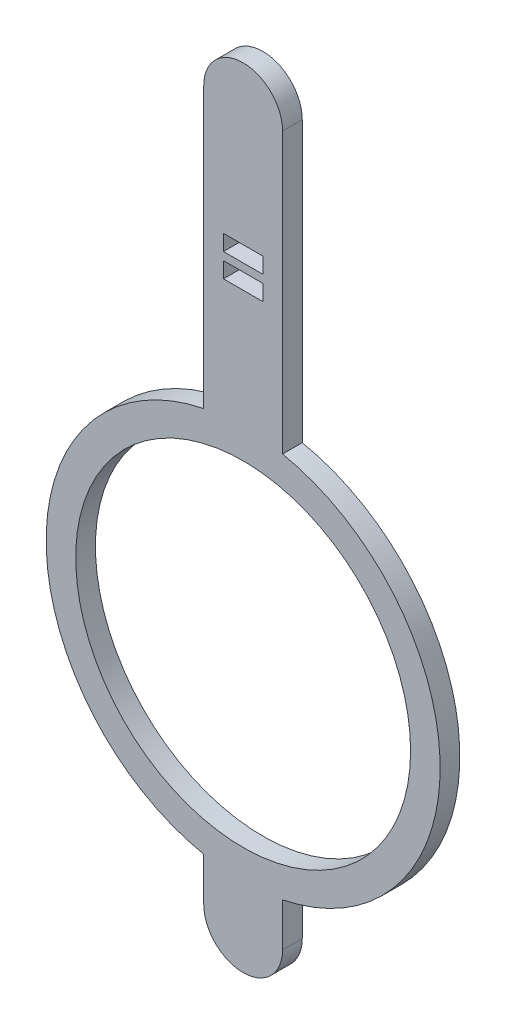
ISO-10303-21;
HEADER;
FILE_DESCRIPTION(('STEP AP214'),'2;1');
FILE_NAME('part.step','',(''),(''),'','','');
FILE_SCHEMA(('AUTOMOTIVE_DESIGN { 1 0 10303 214 1 1 1 1 }'));
ENDSEC;
DATA;
#1=APPLICATION_CONTEXT('core data for automotive mechanical design processes');
#2=APPLICATION_PROTOCOL_DEFINITION('international standard','automotive_design',2000,#1);
#3=PRODUCT_CONTEXT('',#1,'mechanical');
#4=PRODUCT('Part','Part','',(#3));
#5=PRODUCT_RELATED_PRODUCT_CATEGORY('part','',(#4));
#6=PRODUCT_DEFINITION_FORMATION('','',#4);
#7=PRODUCT_DEFINITION_CONTEXT('part definition',#1,'design');
#8=PRODUCT_DEFINITION('design','',#6,#7);
#9=PRODUCT_DEFINITION_SHAPE('','',#8);
#10=(LENGTH_UNIT() NAMED_UNIT(*) SI_UNIT(.MILLI.,.METRE.));
#11=(NAMED_UNIT(*) PLANE_ANGLE_UNIT() SI_UNIT($,.RADIAN.));
#12=(NAMED_UNIT(*) SI_UNIT($,.STERADIAN.) SOLID_ANGLE_UNIT());
#13=UNCERTAINTY_MEASURE_WITH_UNIT(LENGTH_MEASURE(1.E-05),#10,'distance_accuracy_value','');
#14=(GEOMETRIC_REPRESENTATION_CONTEXT(3) GLOBAL_UNCERTAINTY_ASSIGNED_CONTEXT((#13)) GLOBAL_UNIT_ASSIGNED_CONTEXT((#10,
#11,#12)) REPRESENTATION_CONTEXT('',''));
#15=CARTESIAN_POINT('',(0.,0.,0.));
#16=DIRECTION('',(0.,0.,1.));
#17=DIRECTION('',(1.,0.,0.));
#18=AXIS2_PLACEMENT_3D('',#15,#16,#17);
#19=CARTESIAN_POINT('',(0.,6.,0.25));
#20=DIRECTION('',(0.,0.,1.));
#21=DIRECTION('',(1.,0.,0.));
#22=AXIS2_PLACEMENT_3D('',#19,#20,#21);
#23=PLANE('',#22);
#24=DIRECTION('',(0.,-1.,0.));
#25=VECTOR('',#24,1.);
#26=CARTESIAN_POINT('',(0.25,4.2,0.25));
#27=LINE('',#26,#25);
#28=CARTESIAN_POINT('',(0.25,4.2,0.25));
#29=VERTEX_POINT('',#28);
#30=CARTESIAN_POINT('',(0.25,4.,0.25));
#31=VERTEX_POINT('',#30);
#32=EDGE_CURVE('E159',#29,#31,#27,.T.);
#33=ORIENTED_EDGE('',*,*,#32,.T.);
#34=DIRECTION('',(-1.,0.,0.));
#35=VECTOR('',#34,1.);
#36=CARTESIAN_POINT('',(0.25,4.,0.25));
#37=LINE('',#36,#35);
#38=CARTESIAN_POINT('',(-0.25,4.,0.25));
#39=VERTEX_POINT('',#38);
#40=EDGE_CURVE('E148',#31,#39,#37,.T.);
#41=ORIENTED_EDGE('',*,*,#40,.T.);
#42=DIRECTION('',(0.,1.,0.));
#43=VECTOR('',#42,1.);
#44=CARTESIAN_POINT('',(-0.25,4.2,0.25));
#45=LINE('',#44,#43);
#46=CARTESIAN_POINT('',(-0.25,4.2,0.25));
#47=VERTEX_POINT('',#46);
#48=EDGE_CURVE('E169',#39,#47,#45,.T.);
#49=ORIENTED_EDGE('',*,*,#48,.T.);
#50=DIRECTION('',(1.,0.,0.));
#51=VECTOR('',#50,1.);
#52=CARTESIAN_POINT('',(0.25,4.2,0.25));
#53=LINE('',#52,#51);
#54=EDGE_CURVE('E165',#47,#29,#53,.T.);
#55=ORIENTED_EDGE('',*,*,#54,.T.);
#56=EDGE_LOOP('',(#33,#41,#49,#55));
#57=FACE_BOUND('',#56,.T.);
#58=DIRECTION('',(0.,-1.,0.));
#59=VECTOR('',#58,1.);
#60=CARTESIAN_POINT('',(0.25,4.3,0.25));
#61=LINE('',#60,#59);
#62=CARTESIAN_POINT('',(0.25,4.5,0.25));
#63=VERTEX_POINT('',#62);
#64=CARTESIAN_POINT('',(0.25,4.3,0.25));
#65=VERTEX_POINT('',#64);
#66=EDGE_CURVE('E188',#63,#65,#61,.T.);
#67=ORIENTED_EDGE('',*,*,#66,.T.);
#68=DIRECTION('',(-1.,0.,0.));
#69=VECTOR('',#68,1.);
#70=CARTESIAN_POINT('',(0.25,4.3,0.25));
#71=LINE('',#70,#69);
#72=CARTESIAN_POINT('',(-0.25,4.3,0.25));
#73=VERTEX_POINT('',#72);
#74=EDGE_CURVE('E205',#65,#73,#71,.T.);
#75=ORIENTED_EDGE('',*,*,#74,.T.);
#76=DIRECTION('',(0.,1.,0.));
#77=VECTOR('',#76,1.);
#78=CARTESIAN_POINT('',(-0.25,4.3,0.25));
#79=LINE('',#78,#77);
#80=CARTESIAN_POINT('',(-0.25,4.5,0.25));
#81=VERTEX_POINT('',#80);
#82=EDGE_CURVE('E155',#73,#81,#79,.T.);
#83=ORIENTED_EDGE('',*,*,#82,.T.);
#84=DIRECTION('',(1.,0.,0.));
#85=VECTOR('',#84,1.);
#86=CARTESIAN_POINT('',(0.25,4.5,0.25));
#87=LINE('',#86,#85);
#88=EDGE_CURVE('E185',#81,#63,#87,.T.);
#89=ORIENTED_EDGE('',*,*,#88,.T.);
#90=EDGE_LOOP('',(#67,#75,#83,#89));
#91=FACE_BOUND('',#90,.T.);
#92=CARTESIAN_POINT('',(0.,6.,0.25));
#93=DIRECTION('',(0.,0.,1.));
#94=DIRECTION('',(1.,0.,0.));
#95=AXIS2_PLACEMENT_3D('',#92,#93,#94);
#96=CIRCLE('',#95,0.5);
#97=CARTESIAN_POINT('',(0.5,6.,0.25));
#98=VERTEX_POINT('',#97);
#99=CARTESIAN_POINT('',(-0.5,6.,0.25));
#100=VERTEX_POINT('',#99);
#101=EDGE_CURVE('E221',#98,#100,#96,.T.);
#102=ORIENTED_EDGE('',*,*,#101,.T.);
#103=DIRECTION('',(0.,-1.,0.));
#104=VECTOR('',#103,1.);
#105=CARTESIAN_POINT('',(-0.5,2.44948974278318,0.25));
#106=LINE('',#105,#104);
#107=CARTESIAN_POINT('',(-0.5,2.44948974278318,0.25));
#108=VERTEX_POINT('',#107);
#109=EDGE_CURVE('E224',#100,#108,#106,.T.);
#110=ORIENTED_EDGE('',*,*,#109,.T.);
#111=CARTESIAN_POINT('',(0.,0.,0.25));
#112=DIRECTION('',(0.,0.,1.));
#113=DIRECTION('',(1.,0.,0.));
#114=AXIS2_PLACEMENT_3D('',#111,#112,#113);
#115=CIRCLE('',#114,2.5);
#116=CARTESIAN_POINT('',(-0.5,-2.44948974278318,0.25));
#117=VERTEX_POINT('',#116);
#118=EDGE_CURVE('E227',#108,#117,#115,.T.);
#119=ORIENTED_EDGE('',*,*,#118,.T.);
#120=DIRECTION('',(0.,-1.,0.));
#121=VECTOR('',#120,1.);
#122=CARTESIAN_POINT('',(-0.5,-2.44948974278318,0.25));
#123=LINE('',#122,#121);
#124=CARTESIAN_POINT('',(-0.5,-3.,0.25));
#125=VERTEX_POINT('',#124);
#126=EDGE_CURVE('E229',#117,#125,#123,.T.);
#127=ORIENTED_EDGE('',*,*,#126,.T.);
#128=CARTESIAN_POINT('',(0.,-3.,0.25));
#129=DIRECTION('',(0.,0.,1.));
#130=DIRECTION('',(1.,0.,0.));
#131=AXIS2_PLACEMENT_3D('',#128,#129,#130);
#132=CIRCLE('',#131,0.5);
#133=CARTESIAN_POINT('',(0.5,-3.,0.25));
#134=VERTEX_POINT('',#133);
#135=EDGE_CURVE('E231',#125,#134,#132,.T.);
#136=ORIENTED_EDGE('',*,*,#135,.T.);
#137=DIRECTION('',(0.,1.,0.));
#138=VECTOR('',#137,1.);
#139=CARTESIAN_POINT('',(0.5,-2.44948974278318,0.25));
#140=LINE('',#139,#138);
#141=CARTESIAN_POINT('',(0.5,-2.44948974278318,0.25));
#142=VERTEX_POINT('',#141);
#143=EDGE_CURVE('E233',#134,#142,#140,.T.);
#144=ORIENTED_EDGE('',*,*,#143,.T.);
#145=CARTESIAN_POINT('',(0.,0.,0.25));
#146=DIRECTION('',(0.,0.,1.));
#147=DIRECTION('',(1.,0.,0.));
#148=AXIS2_PLACEMENT_3D('',#145,#146,#147);
#149=CIRCLE('',#148,2.5);
#150=CARTESIAN_POINT('',(0.5,2.44948974278318,0.25));
#151=VERTEX_POINT('',#150);
#152=EDGE_CURVE('E235',#142,#151,#149,.T.);
#153=ORIENTED_EDGE('',*,*,#152,.T.);
#154=DIRECTION('',(0.,1.,0.));
#155=VECTOR('',#154,1.);
#156=CARTESIAN_POINT('',(0.5,2.44948974278318,0.25));
#157=LINE('',#156,#155);
#158=EDGE_CURVE('E237',#151,#98,#157,.T.);
#159=ORIENTED_EDGE('',*,*,#158,.T.);
#160=EDGE_LOOP('',(#102,#110,#119,#127,#136,#144,#153,#159));
#161=FACE_BOUND('',#160,.T.);
#162=CARTESIAN_POINT('',(0.,0.,0.25));
#163=DIRECTION('',(0.,0.,1.));
#164=DIRECTION('',(1.,0.,0.));
#165=AXIS2_PLACEMENT_3D('',#162,#163,#164);
#166=CIRCLE('',#165,2.125);
#167=CARTESIAN_POINT('',(2.125,0.,0.25));
#168=VERTEX_POINT('',#167);
#169=EDGE_CURVE('E215',#168,#168,#166,.T.);
#170=ORIENTED_EDGE('',*,*,#169,.F.);
#171=EDGE_LOOP('',(#170));
#172=FACE_BOUND('',#171,.T.);
#173=ADVANCED_FACE('F36',(#57,#91,#161,#172),#23,.T.);
#174=CARTESIAN_POINT('',(0.,6.,0.));
#175=DIRECTION('',(0.,0.,1.));
#176=DIRECTION('',(1.,0.,0.));
#177=AXIS2_PLACEMENT_3D('',#174,#175,#176);
#178=PLANE('',#177);
#179=DIRECTION('',(-1.,0.,0.));
#180=VECTOR('',#179,1.);
#181=CARTESIAN_POINT('',(0.25,4.,0.));
#182=LINE('',#181,#180);
#183=CARTESIAN_POINT('',(0.25,4.,0.));
#184=VERTEX_POINT('',#183);
#185=CARTESIAN_POINT('',(-0.25,4.,0.));
#186=VERTEX_POINT('',#185);
#187=EDGE_CURVE('E167',#184,#186,#182,.T.);
#188=ORIENTED_EDGE('',*,*,#187,.F.);
#189=DIRECTION('',(0.,-1.,0.));
#190=VECTOR('',#189,1.);
#191=CARTESIAN_POINT('',(0.25,4.2,0.));
#192=LINE('',#191,#190);
#193=CARTESIAN_POINT('',(0.25,4.2,0.));
#194=VERTEX_POINT('',#193);
#195=EDGE_CURVE('E59',#194,#184,#192,.T.);
#196=ORIENTED_EDGE('',*,*,#195,.F.);
#197=DIRECTION('',(1.,0.,0.));
#198=VECTOR('',#197,1.);
#199=CARTESIAN_POINT('',(0.25,4.2,0.));
#200=LINE('',#199,#198);
#201=CARTESIAN_POINT('',(-0.25,4.2,0.));
#202=VERTEX_POINT('',#201);
#203=EDGE_CURVE('E161',#202,#194,#200,.T.);
#204=ORIENTED_EDGE('',*,*,#203,.F.);
#205=DIRECTION('',(0.,1.,0.));
#206=VECTOR('',#205,1.);
#207=CARTESIAN_POINT('',(-0.25,4.2,0.));
#208=LINE('',#207,#206);
#209=EDGE_CURVE('E174',#186,#202,#208,.T.);
#210=ORIENTED_EDGE('',*,*,#209,.F.);
#211=EDGE_LOOP('',(#188,#196,#204,#210));
#212=FACE_BOUND('',#211,.T.);
#213=DIRECTION('',(-1.,0.,0.));
#214=VECTOR('',#213,1.);
#215=CARTESIAN_POINT('',(0.25,4.3,0.));
#216=LINE('',#215,#214);
#217=CARTESIAN_POINT('',(0.25,4.3,0.));
#218=VERTEX_POINT('',#217);
#219=CARTESIAN_POINT('',(-0.25,4.3,0.));
#220=VERTEX_POINT('',#219);
#221=EDGE_CURVE('E193',#218,#220,#216,.T.);
#222=ORIENTED_EDGE('',*,*,#221,.F.);
#223=DIRECTION('',(0.,-1.,0.));
#224=VECTOR('',#223,1.);
#225=CARTESIAN_POINT('',(0.25,4.3,0.));
#226=LINE('',#225,#224);
#227=CARTESIAN_POINT('',(0.25,4.5,0.));
#228=VERTEX_POINT('',#227);
#229=EDGE_CURVE('E191',#228,#218,#226,.T.);
#230=ORIENTED_EDGE('',*,*,#229,.F.);
#231=DIRECTION('',(1.,0.,0.));
#232=VECTOR('',#231,1.);
#233=CARTESIAN_POINT('',(0.25,4.5,0.));
#234=LINE('',#233,#232);
#235=CARTESIAN_POINT('',(-0.25,4.5,0.));
#236=VERTEX_POINT('',#235);
#237=EDGE_CURVE('E199',#236,#228,#234,.T.);
#238=ORIENTED_EDGE('',*,*,#237,.F.);
#239=DIRECTION('',(0.,1.,0.));
#240=VECTOR('',#239,1.);
#241=CARTESIAN_POINT('',(-0.25,4.3,0.));
#242=LINE('',#241,#240);
#243=EDGE_CURVE('E196',#220,#236,#242,.T.);
#244=ORIENTED_EDGE('',*,*,#243,.F.);
#245=EDGE_LOOP('',(#222,#230,#238,#244));
#246=FACE_BOUND('',#245,.T.);
#247=CARTESIAN_POINT('',(0.,6.,0.));
#248=DIRECTION('',(0.,0.,1.));
#249=DIRECTION('',(1.,0.,0.));
#250=AXIS2_PLACEMENT_3D('',#247,#248,#249);
#251=CIRCLE('',#250,0.5);
#252=CARTESIAN_POINT('',(0.5,6.,0.));
#253=VERTEX_POINT('',#252);
#254=CARTESIAN_POINT('',(-0.5,6.,0.));
#255=VERTEX_POINT('',#254);
#256=EDGE_CURVE('E218',#253,#255,#251,.T.);
#257=ORIENTED_EDGE('',*,*,#256,.F.);
#258=DIRECTION('',(0.,1.,0.));
#259=VECTOR('',#258,1.);
#260=CARTESIAN_POINT('',(0.5,2.44948974278318,0.));
#261=LINE('',#260,#259);
#262=CARTESIAN_POINT('',(0.5,2.44948974278318,0.));
#263=VERTEX_POINT('',#262);
#264=EDGE_CURVE('E225',#263,#253,#261,.T.);
#265=ORIENTED_EDGE('',*,*,#264,.F.);
#266=CARTESIAN_POINT('',(0.,0.,0.));
#267=DIRECTION('',(0.,0.,1.));
#268=DIRECTION('',(1.,0.,0.));
#269=AXIS2_PLACEMENT_3D('',#266,#267,#268);
#270=CIRCLE('',#269,2.5);
#271=CARTESIAN_POINT('',(0.5,-2.44948974278318,0.));
#272=VERTEX_POINT('',#271);
#273=EDGE_CURVE('E252',#272,#263,#270,.T.);
#274=ORIENTED_EDGE('',*,*,#273,.F.);
#275=DIRECTION('',(0.,1.,0.));
#276=VECTOR('',#275,1.);
#277=CARTESIAN_POINT('',(0.5,-2.44948974278318,0.));
#278=LINE('',#277,#276);
#279=CARTESIAN_POINT('',(0.5,-3.,0.));
#280=VERTEX_POINT('',#279);
#281=EDGE_CURVE('E250',#280,#272,#278,.T.);
#282=ORIENTED_EDGE('',*,*,#281,.F.);
#283=CARTESIAN_POINT('',(0.,-3.,0.));
#284=DIRECTION('',(0.,0.,1.));
#285=DIRECTION('',(1.,0.,0.));
#286=AXIS2_PLACEMENT_3D('',#283,#284,#285);
#287=CIRCLE('',#286,0.5);
#288=CARTESIAN_POINT('',(-0.5,-3.,0.));
#289=VERTEX_POINT('',#288);
#290=EDGE_CURVE('E248',#289,#280,#287,.T.);
#291=ORIENTED_EDGE('',*,*,#290,.F.);
#292=DIRECTION('',(0.,-1.,0.));
#293=VECTOR('',#292,1.);
#294=CARTESIAN_POINT('',(-0.5,-2.44948974278318,0.));
#295=LINE('',#294,#293);
#296=CARTESIAN_POINT('',(-0.5,-2.44948974278318,0.));
#297=VERTEX_POINT('',#296);
#298=EDGE_CURVE('E246',#297,#289,#295,.T.);
#299=ORIENTED_EDGE('',*,*,#298,.F.);
#300=CARTESIAN_POINT('',(0.,0.,0.));
#301=DIRECTION('',(0.,0.,1.));
#302=DIRECTION('',(1.,0.,0.));
#303=AXIS2_PLACEMENT_3D('',#300,#301,#302);
#304=CIRCLE('',#303,2.5);
#305=CARTESIAN_POINT('',(-0.5,2.44948974278318,0.));
#306=VERTEX_POINT('',#305);
#307=EDGE_CURVE('E244',#306,#297,#304,.T.);
#308=ORIENTED_EDGE('',*,*,#307,.F.);
#309=DIRECTION('',(0.,-1.,0.));
#310=VECTOR('',#309,1.);
#311=CARTESIAN_POINT('',(-0.5,2.44948974278318,0.));
#312=LINE('',#311,#310);
#313=EDGE_CURVE('E242',#255,#306,#312,.T.);
#314=ORIENTED_EDGE('',*,*,#313,.F.);
#315=EDGE_LOOP('',(#257,#265,#274,#282,#291,#299,#308,#314));
#316=FACE_BOUND('',#315,.T.);
#317=CARTESIAN_POINT('',(0.,0.,0.));
#318=DIRECTION('',(0.,0.,1.));
#319=DIRECTION('',(1.,0.,0.));
#320=AXIS2_PLACEMENT_3D('',#317,#318,#319);
#321=CIRCLE('',#320,2.125);
#322=CARTESIAN_POINT('',(2.125,0.,0.));
#323=VERTEX_POINT('',#322);
#324=EDGE_CURVE('E214',#323,#323,#321,.T.);
#325=ORIENTED_EDGE('',*,*,#324,.T.);
#326=EDGE_LOOP('',(#325));
#327=FACE_BOUND('',#326,.T.);
#328=ADVANCED_FACE('F282',(#212,#246,#316,#327),#178,.F.);
#329=CARTESIAN_POINT('',(0.,6.,0.25));
#330=DIRECTION('',(0.,0.,-1.));
#331=DIRECTION('',(-1.,0.,0.));
#332=AXIS2_PLACEMENT_3D('',#329,#330,#331);
#333=CYLINDRICAL_SURFACE('',#332,0.5);
#334=ORIENTED_EDGE('',*,*,#256,.T.);
#335=DIRECTION('',(0.,0.,-1.));
#336=VECTOR('',#335,1.);
#337=CARTESIAN_POINT('',(-0.5,6.,0.25));
#338=LINE('',#337,#336);
#339=EDGE_CURVE('E11',#100,#255,#338,.T.);
#340=ORIENTED_EDGE('',*,*,#339,.F.);
#341=ORIENTED_EDGE('',*,*,#101,.F.);
#342=DIRECTION('',(0.,0.,-1.));
#343=VECTOR('',#342,1.);
#344=CARTESIAN_POINT('',(0.5,6.,0.25));
#345=LINE('',#344,#343);
#346=EDGE_CURVE('E239',#98,#253,#345,.T.);
#347=ORIENTED_EDGE('',*,*,#346,.T.);
#348=EDGE_LOOP('',(#334,#340,#341,#347));
#349=FACE_BOUND('',#348,.T.);
#350=ADVANCED_FACE('F38',(#349),#333,.T.);
#351=CARTESIAN_POINT('',(-0.5,2.44948974278318,0.25));
#352=DIRECTION('',(1.,0.,0.));
#353=DIRECTION('',(0.,0.,-1.));
#354=AXIS2_PLACEMENT_3D('',#351,#352,#353);
#355=PLANE('',#354);
#356=ORIENTED_EDGE('',*,*,#313,.T.);
#357=DIRECTION('',(0.,0.,-1.));
#358=VECTOR('',#357,1.);
#359=CARTESIAN_POINT('',(-0.5,2.44948974278318,0.25));
#360=LINE('',#359,#358);
#361=EDGE_CURVE('E44',#108,#306,#360,.T.);
#362=ORIENTED_EDGE('',*,*,#361,.F.);
#363=ORIENTED_EDGE('',*,*,#109,.F.);
#364=ORIENTED_EDGE('',*,*,#339,.T.);
#365=EDGE_LOOP('',(#356,#362,#363,#364));
#366=FACE_BOUND('',#365,.T.);
#367=ADVANCED_FACE('F300',(#366),#355,.F.);
#368=CARTESIAN_POINT('',(0.,0.,0.25));
#369=DIRECTION('',(0.,0.,-1.));
#370=DIRECTION('',(-1.,0.,0.));
#371=AXIS2_PLACEMENT_3D('',#368,#369,#370);
#372=CYLINDRICAL_SURFACE('',#371,2.5);
#373=ORIENTED_EDGE('',*,*,#307,.T.);
#374=DIRECTION('',(0.,0.,-1.));
#375=VECTOR('',#374,1.);
#376=CARTESIAN_POINT('',(-0.5,-2.44948974278318,0.25));
#377=LINE('',#376,#375);
#378=EDGE_CURVE('E269',#117,#297,#377,.T.);
#379=ORIENTED_EDGE('',*,*,#378,.F.);
#380=ORIENTED_EDGE('',*,*,#118,.F.);
#381=ORIENTED_EDGE('',*,*,#361,.T.);
#382=EDGE_LOOP('',(#373,#379,#380,#381));
#383=FACE_BOUND('',#382,.T.);
#384=ADVANCED_FACE('F276',(#383),#372,.T.);
#385=CARTESIAN_POINT('',(-0.5,-2.44948974278318,0.25));
#386=DIRECTION('',(1.,0.,0.));
#387=DIRECTION('',(0.,0.,-1.));
#388=AXIS2_PLACEMENT_3D('',#385,#386,#387);
#389=PLANE('',#388);
#390=ORIENTED_EDGE('',*,*,#298,.T.);
#391=DIRECTION('',(0.,0.,-1.));
#392=VECTOR('',#391,1.);
#393=CARTESIAN_POINT('',(-0.5,-3.,0.25));
#394=LINE('',#393,#392);
#395=EDGE_CURVE('E266',#125,#289,#394,.T.);
#396=ORIENTED_EDGE('',*,*,#395,.F.);
#397=ORIENTED_EDGE('',*,*,#126,.F.);
#398=ORIENTED_EDGE('',*,*,#378,.T.);
#399=EDGE_LOOP('',(#390,#396,#397,#398));
#400=FACE_BOUND('',#399,.T.);
#401=ADVANCED_FACE('F288',(#400),#389,.F.);
#402=CARTESIAN_POINT('',(0.,-3.,0.25));
#403=DIRECTION('',(0.,0.,-1.));
#404=DIRECTION('',(-1.,0.,0.));
#405=AXIS2_PLACEMENT_3D('',#402,#403,#404);
#406=CYLINDRICAL_SURFACE('',#405,0.5);
#407=ORIENTED_EDGE('',*,*,#290,.T.);
#408=DIRECTION('',(0.,0.,-1.));
#409=VECTOR('',#408,1.);
#410=CARTESIAN_POINT('',(0.5,-3.,0.25));
#411=LINE('',#410,#409);
#412=EDGE_CURVE('E263',#134,#280,#411,.T.);
#413=ORIENTED_EDGE('',*,*,#412,.F.);
#414=ORIENTED_EDGE('',*,*,#135,.F.);
#415=ORIENTED_EDGE('',*,*,#395,.T.);
#416=EDGE_LOOP('',(#407,#413,#414,#415));
#417=FACE_BOUND('',#416,.T.);
#418=ADVANCED_FACE('F292',(#417),#406,.T.);
#419=CARTESIAN_POINT('',(0.5,-2.44948974278318,0.25));
#420=DIRECTION('',(-1.,0.,0.));
#421=DIRECTION('',(0.,-1.,0.));
#422=AXIS2_PLACEMENT_3D('',#419,#420,#421);
#423=PLANE('',#422);
#424=ORIENTED_EDGE('',*,*,#281,.T.);
#425=DIRECTION('',(0.,0.,-1.));
#426=VECTOR('',#425,1.);
#427=CARTESIAN_POINT('',(0.5,-2.44948974278318,0.25));
#428=LINE('',#427,#426);
#429=EDGE_CURVE('E260',#142,#272,#428,.T.);
#430=ORIENTED_EDGE('',*,*,#429,.F.);
#431=ORIENTED_EDGE('',*,*,#143,.F.);
#432=ORIENTED_EDGE('',*,*,#412,.T.);
#433=EDGE_LOOP('',(#424,#430,#431,#432));
#434=FACE_BOUND('',#433,.T.);
#435=ADVANCED_FACE('F313',(#434),#423,.F.);
#436=CARTESIAN_POINT('',(0.,0.,0.25));
#437=DIRECTION('',(0.,0.,-1.));
#438=DIRECTION('',(-1.,0.,0.));
#439=AXIS2_PLACEMENT_3D('',#436,#437,#438);
#440=CYLINDRICAL_SURFACE('',#439,2.5);
#441=ORIENTED_EDGE('',*,*,#273,.T.);
#442=DIRECTION('',(0.,0.,-1.));
#443=VECTOR('',#442,1.);
#444=CARTESIAN_POINT('',(0.5,2.44948974278318,0.25));
#445=LINE('',#444,#443);
#446=EDGE_CURVE('E257',#151,#263,#445,.T.);
#447=ORIENTED_EDGE('',*,*,#446,.F.);
#448=ORIENTED_EDGE('',*,*,#152,.F.);
#449=ORIENTED_EDGE('',*,*,#429,.T.);
#450=EDGE_LOOP('',(#441,#447,#448,#449));
#451=FACE_BOUND('',#450,.T.);
#452=ADVANCED_FACE('F311',(#451),#440,.T.);
#453=CARTESIAN_POINT('',(0.5,2.44948974278318,0.25));
#454=DIRECTION('',(-1.,0.,0.));
#455=DIRECTION('',(0.,0.,1.));
#456=AXIS2_PLACEMENT_3D('',#453,#454,#455);
#457=PLANE('',#456);
#458=ORIENTED_EDGE('',*,*,#264,.T.);
#459=ORIENTED_EDGE('',*,*,#346,.F.);
#460=ORIENTED_EDGE('',*,*,#158,.F.);
#461=ORIENTED_EDGE('',*,*,#446,.T.);
#462=EDGE_LOOP('',(#458,#459,#460,#461));
#463=FACE_BOUND('',#462,.T.);
#464=ADVANCED_FACE('F306',(#463),#457,.F.);
#465=CARTESIAN_POINT('',(0.,0.,0.25));
#466=DIRECTION('',(0.,0.,-1.));
#467=DIRECTION('',(-1.,0.,0.));
#468=AXIS2_PLACEMENT_3D('',#465,#466,#467);
#469=CYLINDRICAL_SURFACE('',#468,2.125);
#470=ORIENTED_EDGE('',*,*,#324,.F.);
#471=EDGE_LOOP('',(#470));
#472=FACE_BOUND('',#471,.T.);
#473=ORIENTED_EDGE('',*,*,#169,.T.);
#474=EDGE_LOOP('',(#473));
#475=FACE_BOUND('',#474,.T.);
#476=ADVANCED_FACE('F330',(#472,#475),#469,.F.);
#477=CARTESIAN_POINT('',(0.25,4.3,0.251));
#478=DIRECTION('',(1.,0.,0.));
#479=DIRECTION('',(0.,0.,-1.));
#480=AXIS2_PLACEMENT_3D('',#477,#478,#479);
#481=PLANE('',#480);
#482=DIRECTION('',(0.,0.,-1.));
#483=VECTOR('',#482,1.);
#484=CARTESIAN_POINT('',(0.25,4.5,0.251));
#485=LINE('',#484,#483);
#486=EDGE_CURVE('E203',#63,#228,#485,.T.);
#487=ORIENTED_EDGE('',*,*,#486,.T.);
#488=ORIENTED_EDGE('',*,*,#229,.T.);
#489=DIRECTION('',(0.,0.,-1.));
#490=VECTOR('',#489,1.);
#491=CARTESIAN_POINT('',(0.25,4.3,0.251));
#492=LINE('',#491,#490);
#493=EDGE_CURVE('E202',#65,#218,#492,.T.);
#494=ORIENTED_EDGE('',*,*,#493,.F.);
#495=ORIENTED_EDGE('',*,*,#66,.F.);
#496=EDGE_LOOP('',(#487,#488,#494,#495));
#497=FACE_BOUND('',#496,.T.);
#498=ADVANCED_FACE('F337',(#497),#481,.F.);
#499=CARTESIAN_POINT('',(0.25,4.5,0.251));
#500=DIRECTION('',(0.,1.,0.));
#501=DIRECTION('',(0.,0.,1.));
#502=AXIS2_PLACEMENT_3D('',#499,#500,#501);
#503=PLANE('',#502);
#504=DIRECTION('',(0.,0.,-1.));
#505=VECTOR('',#504,1.);
#506=CARTESIAN_POINT('',(-0.25,4.5,0.251));
#507=LINE('',#506,#505);
#508=EDGE_CURVE('E206',#81,#236,#507,.T.);
#509=ORIENTED_EDGE('',*,*,#508,.T.);
#510=ORIENTED_EDGE('',*,*,#237,.T.);
#511=ORIENTED_EDGE('',*,*,#486,.F.);
#512=ORIENTED_EDGE('',*,*,#88,.F.);
#513=EDGE_LOOP('',(#509,#510,#511,#512));
#514=FACE_BOUND('',#513,.T.);
#515=ADVANCED_FACE('F342',(#514),#503,.F.);
#516=CARTESIAN_POINT('',(-0.25,4.3,0.251));
#517=DIRECTION('',(-1.,0.,0.));
#518=DIRECTION('',(0.,0.,1.));
#519=AXIS2_PLACEMENT_3D('',#516,#517,#518);
#520=PLANE('',#519);
#521=DIRECTION('',(0.,0.,-1.));
#522=VECTOR('',#521,1.);
#523=CARTESIAN_POINT('',(-0.25,4.3,0.251));
#524=LINE('',#523,#522);
#525=EDGE_CURVE('E208',#73,#220,#524,.T.);
#526=ORIENTED_EDGE('',*,*,#525,.T.);
#527=ORIENTED_EDGE('',*,*,#243,.T.);
#528=ORIENTED_EDGE('',*,*,#508,.F.);
#529=ORIENTED_EDGE('',*,*,#82,.F.);
#530=EDGE_LOOP('',(#526,#527,#528,#529));
#531=FACE_BOUND('',#530,.T.);
#532=ADVANCED_FACE('F350',(#531),#520,.F.);
#533=CARTESIAN_POINT('',(0.25,4.3,0.251));
#534=DIRECTION('',(0.,-1.,0.));
#535=DIRECTION('',(0.,0.,-1.));
#536=AXIS2_PLACEMENT_3D('',#533,#534,#535);
#537=PLANE('',#536);
#538=ORIENTED_EDGE('',*,*,#493,.T.);
#539=ORIENTED_EDGE('',*,*,#221,.T.);
#540=ORIENTED_EDGE('',*,*,#525,.F.);
#541=ORIENTED_EDGE('',*,*,#74,.F.);
#542=EDGE_LOOP('',(#538,#539,#540,#541));
#543=FACE_BOUND('',#542,.T.);
#544=ADVANCED_FACE('F354',(#543),#537,.F.);
#545=CARTESIAN_POINT('',(0.25,4.2,0.251));
#546=DIRECTION('',(1.,0.,0.));
#547=DIRECTION('',(0.,0.,-1.));
#548=AXIS2_PLACEMENT_3D('',#545,#546,#547);
#549=PLANE('',#548);
#550=DIRECTION('',(0.,0.,-1.));
#551=VECTOR('',#550,1.);
#552=CARTESIAN_POINT('',(0.25,4.2,0.251));
#553=LINE('',#552,#551);
#554=EDGE_CURVE('E156',#29,#194,#553,.T.);
#555=ORIENTED_EDGE('',*,*,#554,.T.);
#556=ORIENTED_EDGE('',*,*,#195,.T.);
#557=DIRECTION('',(0.,0.,-1.));
#558=VECTOR('',#557,1.);
#559=CARTESIAN_POINT('',(0.25,4.,0.251));
#560=LINE('',#559,#558);
#561=EDGE_CURVE('E150',#31,#184,#560,.T.);
#562=ORIENTED_EDGE('',*,*,#561,.F.);
#563=ORIENTED_EDGE('',*,*,#32,.F.);
#564=EDGE_LOOP('',(#555,#556,#562,#563));
#565=FACE_BOUND('',#564,.T.);
#566=ADVANCED_FACE('F158',(#565),#549,.F.);
#567=CARTESIAN_POINT('',(0.25,4.2,0.251));
#568=DIRECTION('',(0.,1.,0.));
#569=DIRECTION('',(0.,0.,1.));
#570=AXIS2_PLACEMENT_3D('',#567,#568,#569);
#571=PLANE('',#570);
#572=DIRECTION('',(0.,0.,-1.));
#573=VECTOR('',#572,1.);
#574=CARTESIAN_POINT('',(-0.25,4.2,0.251));
#575=LINE('',#574,#573);
#576=EDGE_CURVE('E180',#47,#202,#575,.T.);
#577=ORIENTED_EDGE('',*,*,#576,.T.);
#578=ORIENTED_EDGE('',*,*,#203,.T.);
#579=ORIENTED_EDGE('',*,*,#554,.F.);
#580=ORIENTED_EDGE('',*,*,#54,.F.);
#581=EDGE_LOOP('',(#577,#578,#579,#580));
#582=FACE_BOUND('',#581,.T.);
#583=ADVANCED_FACE('F363',(#582),#571,.F.);
#584=CARTESIAN_POINT('',(-0.25,4.2,0.251));
#585=DIRECTION('',(-1.,0.,0.));
#586=DIRECTION('',(0.,0.,1.));
#587=AXIS2_PLACEMENT_3D('',#584,#585,#586);
#588=PLANE('',#587);
#589=DIRECTION('',(0.,0.,-1.));
#590=VECTOR('',#589,1.);
#591=CARTESIAN_POINT('',(-0.25,4.,0.251));
#592=LINE('',#591,#590);
#593=EDGE_CURVE('E51',#39,#186,#592,.T.);
#594=ORIENTED_EDGE('',*,*,#593,.T.);
#595=ORIENTED_EDGE('',*,*,#209,.T.);
#596=ORIENTED_EDGE('',*,*,#576,.F.);
#597=ORIENTED_EDGE('',*,*,#48,.F.);
#598=EDGE_LOOP('',(#594,#595,#596,#597));
#599=FACE_BOUND('',#598,.T.);
#600=ADVANCED_FACE('F366',(#599),#588,.F.);
#601=CARTESIAN_POINT('',(0.25,4.,0.251));
#602=DIRECTION('',(0.,-1.,0.));
#603=DIRECTION('',(0.,0.,-1.));
#604=AXIS2_PLACEMENT_3D('',#601,#602,#603);
#605=PLANE('',#604);
#606=ORIENTED_EDGE('',*,*,#561,.T.);
#607=ORIENTED_EDGE('',*,*,#187,.T.);
#608=ORIENTED_EDGE('',*,*,#593,.F.);
#609=ORIENTED_EDGE('',*,*,#40,.F.);
#610=EDGE_LOOP('',(#606,#607,#608,#609));
#611=FACE_BOUND('',#610,.T.);
#612=ADVANCED_FACE('F149',(#611),#605,.F.);
#613=CLOSED_SHELL('',(#173,#328,#350,#367,#384,#401,#418,#435,#452,#464,#476,#498,#515,#532,
#544,#566,#583,#600,#612));
#614=MANIFOLD_SOLID_BREP('B2',#613);
#615=ADVANCED_BREP_SHAPE_REPRESENTATION('',(#18,#614),#14);
#616=SHAPE_DEFINITION_REPRESENTATION(#9,#615);
ENDSEC;
END-ISO-10303-21;
